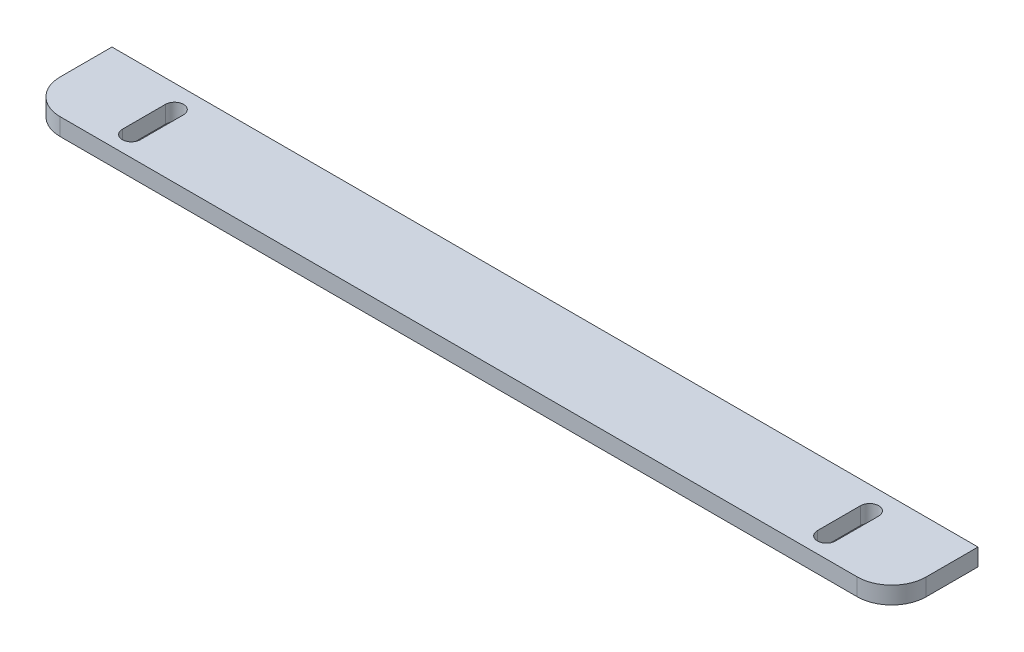
ISO-10303-21;
HEADER;
FILE_DESCRIPTION(('STEP AP214'),'2;1');
FILE_NAME('part.step','',(''),(''),'','','');
FILE_SCHEMA(('AUTOMOTIVE_DESIGN { 1 0 10303 214 1 1 1 1 }'));
ENDSEC;
DATA;
#1=APPLICATION_CONTEXT('core data for automotive mechanical design processes');
#2=APPLICATION_PROTOCOL_DEFINITION('international standard','automotive_design',2000,#1);
#3=PRODUCT_CONTEXT('',#1,'mechanical');
#4=PRODUCT('Part','Part','',(#3));
#5=PRODUCT_RELATED_PRODUCT_CATEGORY('part','',(#4));
#6=PRODUCT_DEFINITION_FORMATION('','',#4);
#7=PRODUCT_DEFINITION_CONTEXT('part definition',#1,'design');
#8=PRODUCT_DEFINITION('design','',#6,#7);
#9=PRODUCT_DEFINITION_SHAPE('','',#8);
#10=(LENGTH_UNIT() NAMED_UNIT(*) SI_UNIT(.MILLI.,.METRE.));
#11=(NAMED_UNIT(*) PLANE_ANGLE_UNIT() SI_UNIT($,.RADIAN.));
#12=(NAMED_UNIT(*) SI_UNIT($,.STERADIAN.) SOLID_ANGLE_UNIT());
#13=UNCERTAINTY_MEASURE_WITH_UNIT(LENGTH_MEASURE(1.E-05),#10,'distance_accuracy_value','');
#14=(GEOMETRIC_REPRESENTATION_CONTEXT(3) GLOBAL_UNCERTAINTY_ASSIGNED_CONTEXT((#13)) GLOBAL_UNIT_ASSIGNED_CONTEXT((#10,
#11,#12)) REPRESENTATION_CONTEXT('',''));
#15=CARTESIAN_POINT('',(0.,0.,0.));
#16=DIRECTION('',(0.,0.,1.));
#17=DIRECTION('',(1.,0.,0.));
#18=AXIS2_PLACEMENT_3D('',#15,#16,#17);
#19=CARTESIAN_POINT('',(10.,5.,-10.));
#20=DIRECTION('',(0.,-1.,0.));
#21=DIRECTION('',(0.,0.,-1.));
#22=AXIS2_PLACEMENT_3D('',#19,#20,#21);
#23=PLANE('',#22);
#24=CARTESIAN_POINT('',(24.77,5.,-18.3595406360424));
#25=DIRECTION('',(0.,1.,0.));
#26=DIRECTION('',(0.,0.,1.));
#27=AXIS2_PLACEMENT_3D('',#24,#25,#26);
#28=CIRCLE('',#27,2.62500000000004);
#29=CARTESIAN_POINT('',(27.3950000000001,5.,-18.3595406360424));
#30=VERTEX_POINT('',#29);
#31=CARTESIAN_POINT('',(22.145,5.,-18.3595406360424));
#32=VERTEX_POINT('',#31);
#33=EDGE_CURVE('E170',#30,#32,#28,.T.);
#34=ORIENTED_EDGE('',*,*,#33,.F.);
#35=DIRECTION('',(0.,0.,-1.));
#36=VECTOR('',#35,1.);
#37=CARTESIAN_POINT('',(27.3950000000001,5.,-18.3595406360424));
#38=LINE('',#37,#36);
#39=CARTESIAN_POINT('',(27.395,5.,-5.85954063604238));
#40=VERTEX_POINT('',#39);
#41=EDGE_CURVE('E178',#40,#30,#38,.T.);
#42=ORIENTED_EDGE('',*,*,#41,.F.);
#43=CARTESIAN_POINT('',(24.77,5.,-5.85954063604238));
#44=DIRECTION('',(0.,1.,0.));
#45=DIRECTION('',(0.,0.,1.));
#46=AXIS2_PLACEMENT_3D('',#43,#44,#45);
#47=CIRCLE('',#46,2.62499999999999);
#48=CARTESIAN_POINT('',(22.145,5.,-5.85954063604238));
#49=VERTEX_POINT('',#48);
#50=EDGE_CURVE('E175',#49,#40,#47,.T.);
#51=ORIENTED_EDGE('',*,*,#50,.F.);
#52=DIRECTION('',(0.,0.,1.));
#53=VECTOR('',#52,1.);
#54=CARTESIAN_POINT('',(22.145,5.,-18.3595406360424));
#55=LINE('',#54,#53);
#56=EDGE_CURVE('E172',#32,#49,#55,.T.);
#57=ORIENTED_EDGE('',*,*,#56,.F.);
#58=EDGE_LOOP('',(#34,#42,#51,#57));
#59=FACE_BOUND('',#58,.T.);
#60=DIRECTION('',(0.,0.,-1.));
#61=VECTOR('',#60,1.);
#62=CARTESIAN_POINT('',(251.,5.,-10.));
#63=LINE('',#62,#61);
#64=CARTESIAN_POINT('',(251.,5.,-10.));
#65=VERTEX_POINT('',#64);
#66=CARTESIAN_POINT('',(251.,5.,-25.));
#67=VERTEX_POINT('',#66);
#68=EDGE_CURVE('E201',#65,#67,#63,.T.);
#69=ORIENTED_EDGE('',*,*,#68,.T.);
#70=DIRECTION('',(-1.,0.,0.));
#71=VECTOR('',#70,1.);
#72=CARTESIAN_POINT('',(0.,5.,-25.));
#73=LINE('',#72,#71);
#74=CARTESIAN_POINT('',(0.,5.,-25.));
#75=VERTEX_POINT('',#74);
#76=EDGE_CURVE('E204',#67,#75,#73,.T.);
#77=ORIENTED_EDGE('',*,*,#76,.T.);
#78=DIRECTION('',(0.,0.,1.));
#79=VECTOR('',#78,1.);
#80=CARTESIAN_POINT('',(0.,5.,-10.));
#81=LINE('',#80,#79);
#82=CARTESIAN_POINT('',(0.,5.,-10.));
#83=VERTEX_POINT('',#82);
#84=EDGE_CURVE('E207',#75,#83,#81,.T.);
#85=ORIENTED_EDGE('',*,*,#84,.T.);
#86=CARTESIAN_POINT('',(10.,5.,-10.));
#87=DIRECTION('',(0.,1.,0.));
#88=DIRECTION('',(0.,0.,-1.));
#89=AXIS2_PLACEMENT_3D('',#86,#87,#88);
#90=CIRCLE('',#89,10.);
#91=CARTESIAN_POINT('',(10.,5.,0.));
#92=VERTEX_POINT('',#91);
#93=EDGE_CURVE('E209',#83,#92,#90,.T.);
#94=ORIENTED_EDGE('',*,*,#93,.T.);
#95=DIRECTION('',(1.,0.,0.));
#96=VECTOR('',#95,1.);
#97=CARTESIAN_POINT('',(10.,5.,0.));
#98=LINE('',#97,#96);
#99=CARTESIAN_POINT('',(241.,5.,0.));
#100=VERTEX_POINT('',#99);
#101=EDGE_CURVE('E211',#92,#100,#98,.T.);
#102=ORIENTED_EDGE('',*,*,#101,.T.);
#103=CARTESIAN_POINT('',(241.,5.,-10.));
#104=DIRECTION('',(0.,1.,0.));
#105=DIRECTION('',(0.,0.,1.));
#106=AXIS2_PLACEMENT_3D('',#103,#104,#105);
#107=CIRCLE('',#106,9.99999999999999);
#108=EDGE_CURVE('E213',#100,#65,#107,.T.);
#109=ORIENTED_EDGE('',*,*,#108,.T.);
#110=EDGE_LOOP('',(#69,#77,#85,#94,#102,#109));
#111=FACE_BOUND('',#110,.T.);
#112=CARTESIAN_POINT('',(226.23,5.,-18.3595406360424));
#113=DIRECTION('',(0.,1.,0.));
#114=DIRECTION('',(0.,0.,-1.));
#115=AXIS2_PLACEMENT_3D('',#112,#113,#114);
#116=CIRCLE('',#115,2.62500000000004);
#117=CARTESIAN_POINT('',(228.855,5.,-18.3595406360424));
#118=VERTEX_POINT('',#117);
#119=CARTESIAN_POINT('',(223.605,5.,-18.3595406360424));
#120=VERTEX_POINT('',#119);
#121=EDGE_CURVE('E134',#118,#120,#116,.T.);
#122=ORIENTED_EDGE('',*,*,#121,.F.);
#123=DIRECTION('',(0.,0.,-1.));
#124=VECTOR('',#123,1.);
#125=CARTESIAN_POINT('',(228.855,5.,-18.3595406360424));
#126=LINE('',#125,#124);
#127=CARTESIAN_POINT('',(228.855,5.,-5.85954063604238));
#128=VERTEX_POINT('',#127);
#129=EDGE_CURVE('E156',#128,#118,#126,.T.);
#130=ORIENTED_EDGE('',*,*,#129,.F.);
#131=CARTESIAN_POINT('',(226.23,5.,-5.85954063604238));
#132=DIRECTION('',(0.,1.,0.));
#133=DIRECTION('',(0.,0.,-1.));
#134=AXIS2_PLACEMENT_3D('',#131,#132,#133);
#135=CIRCLE('',#134,2.62499999999999);
#136=CARTESIAN_POINT('',(223.605,5.,-5.85954063604238));
#137=VERTEX_POINT('',#136);
#138=EDGE_CURVE('E154',#137,#128,#135,.T.);
#139=ORIENTED_EDGE('',*,*,#138,.F.);
#140=DIRECTION('',(0.,0.,1.));
#141=VECTOR('',#140,1.);
#142=CARTESIAN_POINT('',(223.605,5.,-18.3595406360424));
#143=LINE('',#142,#141);
#144=EDGE_CURVE('E142',#120,#137,#143,.T.);
#145=ORIENTED_EDGE('',*,*,#144,.F.);
#146=EDGE_LOOP('',(#122,#130,#139,#145));
#147=FACE_BOUND('',#146,.T.);
#148=ADVANCED_FACE('F33',(#59,#111,#147),#23,.F.);
#149=CARTESIAN_POINT('',(10.,0.,-10.));
#150=DIRECTION('',(0.,-1.,0.));
#151=DIRECTION('',(0.,0.,-1.));
#152=AXIS2_PLACEMENT_3D('',#149,#150,#151);
#153=PLANE('',#152);
#154=DIRECTION('',(0.,0.,-1.));
#155=VECTOR('',#154,1.);
#156=CARTESIAN_POINT('',(27.3950000000001,0.,-18.3595406360424));
#157=LINE('',#156,#155);
#158=CARTESIAN_POINT('',(27.395,0.,-5.85954063604238));
#159=VERTEX_POINT('',#158);
#160=CARTESIAN_POINT('',(27.3950000000001,0.,-18.3595406360424));
#161=VERTEX_POINT('',#160);
#162=EDGE_CURVE('E173',#159,#161,#157,.T.);
#163=ORIENTED_EDGE('',*,*,#162,.T.);
#164=CARTESIAN_POINT('',(24.77,0.,-18.3595406360424));
#165=DIRECTION('',(0.,1.,0.));
#166=DIRECTION('',(0.,0.,1.));
#167=AXIS2_PLACEMENT_3D('',#164,#165,#166);
#168=CIRCLE('',#167,2.62500000000004);
#169=CARTESIAN_POINT('',(22.145,0.,-18.3595406360424));
#170=VERTEX_POINT('',#169);
#171=EDGE_CURVE('E150',#161,#170,#168,.T.);
#172=ORIENTED_EDGE('',*,*,#171,.T.);
#173=DIRECTION('',(0.,0.,1.));
#174=VECTOR('',#173,1.);
#175=CARTESIAN_POINT('',(22.145,0.,-18.3595406360424));
#176=LINE('',#175,#174);
#177=CARTESIAN_POINT('',(22.145,0.,-5.85954063604238));
#178=VERTEX_POINT('',#177);
#179=EDGE_CURVE('E183',#170,#178,#176,.T.);
#180=ORIENTED_EDGE('',*,*,#179,.T.);
#181=CARTESIAN_POINT('',(24.77,0.,-5.85954063604238));
#182=DIRECTION('',(0.,1.,0.));
#183=DIRECTION('',(0.,0.,1.));
#184=AXIS2_PLACEMENT_3D('',#181,#182,#183);
#185=CIRCLE('',#184,2.62499999999999);
#186=EDGE_CURVE('E186',#178,#159,#185,.T.);
#187=ORIENTED_EDGE('',*,*,#186,.T.);
#188=EDGE_LOOP('',(#163,#172,#180,#187));
#189=FACE_BOUND('',#188,.T.);
#190=DIRECTION('',(0.,0.,-1.));
#191=VECTOR('',#190,1.);
#192=CARTESIAN_POINT('',(251.,0.,-10.));
#193=LINE('',#192,#191);
#194=CARTESIAN_POINT('',(251.,0.,-10.));
#195=VERTEX_POINT('',#194);
#196=CARTESIAN_POINT('',(251.,0.,-25.));
#197=VERTEX_POINT('',#196);
#198=EDGE_CURVE('E200',#195,#197,#193,.T.);
#199=ORIENTED_EDGE('',*,*,#198,.F.);
#200=CARTESIAN_POINT('',(241.,0.,-10.));
#201=DIRECTION('',(0.,1.,0.));
#202=DIRECTION('',(0.,0.,1.));
#203=AXIS2_PLACEMENT_3D('',#200,#201,#202);
#204=CIRCLE('',#203,9.99999999999999);
#205=CARTESIAN_POINT('',(241.,0.,0.));
#206=VERTEX_POINT('',#205);
#207=EDGE_CURVE('E205',#206,#195,#204,.T.);
#208=ORIENTED_EDGE('',*,*,#207,.F.);
#209=DIRECTION('',(1.,0.,0.));
#210=VECTOR('',#209,1.);
#211=CARTESIAN_POINT('',(10.,0.,0.));
#212=LINE('',#211,#210);
#213=CARTESIAN_POINT('',(10.,0.,0.));
#214=VERTEX_POINT('',#213);
#215=EDGE_CURVE('E224',#214,#206,#212,.T.);
#216=ORIENTED_EDGE('',*,*,#215,.F.);
#217=CARTESIAN_POINT('',(10.,0.,-10.));
#218=DIRECTION('',(0.,1.,0.));
#219=DIRECTION('',(0.,0.,-1.));
#220=AXIS2_PLACEMENT_3D('',#217,#218,#219);
#221=CIRCLE('',#220,10.);
#222=CARTESIAN_POINT('',(0.,0.,-10.));
#223=VERTEX_POINT('',#222);
#224=EDGE_CURVE('E222',#223,#214,#221,.T.);
#225=ORIENTED_EDGE('',*,*,#224,.F.);
#226=DIRECTION('',(0.,0.,1.));
#227=VECTOR('',#226,1.);
#228=CARTESIAN_POINT('',(0.,0.,-10.));
#229=LINE('',#228,#227);
#230=CARTESIAN_POINT('',(0.,0.,-25.));
#231=VERTEX_POINT('',#230);
#232=EDGE_CURVE('E220',#231,#223,#229,.T.);
#233=ORIENTED_EDGE('',*,*,#232,.F.);
#234=DIRECTION('',(-1.,0.,0.));
#235=VECTOR('',#234,1.);
#236=CARTESIAN_POINT('',(0.,0.,-25.));
#237=LINE('',#236,#235);
#238=EDGE_CURVE('E218',#197,#231,#237,.T.);
#239=ORIENTED_EDGE('',*,*,#238,.F.);
#240=EDGE_LOOP('',(#199,#208,#216,#225,#233,#239));
#241=FACE_BOUND('',#240,.T.);
#242=DIRECTION('',(0.,0.,-1.));
#243=VECTOR('',#242,1.);
#244=CARTESIAN_POINT('',(228.855,0.,-18.3595406360424));
#245=LINE('',#244,#243);
#246=CARTESIAN_POINT('',(228.855,0.,-5.85954063604238));
#247=VERTEX_POINT('',#246);
#248=CARTESIAN_POINT('',(228.855,0.,-18.3595406360424));
#249=VERTEX_POINT('',#248);
#250=EDGE_CURVE('E143',#247,#249,#245,.T.);
#251=ORIENTED_EDGE('',*,*,#250,.T.);
#252=CARTESIAN_POINT('',(226.23,0.,-18.3595406360424));
#253=DIRECTION('',(0.,1.,0.));
#254=DIRECTION('',(0.,0.,-1.));
#255=AXIS2_PLACEMENT_3D('',#252,#253,#254);
#256=CIRCLE('',#255,2.62500000000004);
#257=CARTESIAN_POINT('',(223.605,0.,-18.3595406360424));
#258=VERTEX_POINT('',#257);
#259=EDGE_CURVE('E56',#249,#258,#256,.T.);
#260=ORIENTED_EDGE('',*,*,#259,.T.);
#261=DIRECTION('',(0.,0.,1.));
#262=VECTOR('',#261,1.);
#263=CARTESIAN_POINT('',(223.605,0.,-18.3595406360424));
#264=LINE('',#263,#262);
#265=CARTESIAN_POINT('',(223.605,0.,-5.85954063604238));
#266=VERTEX_POINT('',#265);
#267=EDGE_CURVE('E149',#258,#266,#264,.T.);
#268=ORIENTED_EDGE('',*,*,#267,.T.);
#269=CARTESIAN_POINT('',(226.23,0.,-5.85954063604238));
#270=DIRECTION('',(0.,1.,0.));
#271=DIRECTION('',(0.,0.,-1.));
#272=AXIS2_PLACEMENT_3D('',#269,#270,#271);
#273=CIRCLE('',#272,2.62499999999999);
#274=EDGE_CURVE('E162',#266,#247,#273,.T.);
#275=ORIENTED_EDGE('',*,*,#274,.T.);
#276=EDGE_LOOP('',(#251,#260,#268,#275));
#277=FACE_BOUND('',#276,.T.);
#278=ADVANCED_FACE('F248',(#189,#241,#277),#153,.T.);
#279=CARTESIAN_POINT('',(251.,5.,-10.));
#280=DIRECTION('',(-1.,0.,0.));
#281=DIRECTION('',(0.,0.,1.));
#282=AXIS2_PLACEMENT_3D('',#279,#280,#281);
#283=PLANE('',#282);
#284=ORIENTED_EDGE('',*,*,#198,.T.);
#285=DIRECTION('',(0.,-1.,0.));
#286=VECTOR('',#285,1.);
#287=CARTESIAN_POINT('',(251.,5.,-25.));
#288=LINE('',#287,#286);
#289=EDGE_CURVE('E11',#67,#197,#288,.T.);
#290=ORIENTED_EDGE('',*,*,#289,.F.);
#291=ORIENTED_EDGE('',*,*,#68,.F.);
#292=DIRECTION('',(0.,-1.,0.));
#293=VECTOR('',#292,1.);
#294=CARTESIAN_POINT('',(251.,5.,-10.));
#295=LINE('',#294,#293);
#296=EDGE_CURVE('E215',#65,#195,#295,.T.);
#297=ORIENTED_EDGE('',*,*,#296,.T.);
#298=EDGE_LOOP('',(#284,#290,#291,#297));
#299=FACE_BOUND('',#298,.T.);
#300=ADVANCED_FACE('F35',(#299),#283,.F.);
#301=CARTESIAN_POINT('',(0.,5.,-25.));
#302=DIRECTION('',(0.,0.,1.));
#303=DIRECTION('',(1.,0.,0.));
#304=AXIS2_PLACEMENT_3D('',#301,#302,#303);
#305=PLANE('',#304);
#306=ORIENTED_EDGE('',*,*,#238,.T.);
#307=DIRECTION('',(0.,-1.,0.));
#308=VECTOR('',#307,1.);
#309=CARTESIAN_POINT('',(0.,5.,-25.));
#310=LINE('',#309,#308);
#311=EDGE_CURVE('E41',#75,#231,#310,.T.);
#312=ORIENTED_EDGE('',*,*,#311,.F.);
#313=ORIENTED_EDGE('',*,*,#76,.F.);
#314=ORIENTED_EDGE('',*,*,#289,.T.);
#315=EDGE_LOOP('',(#306,#312,#313,#314));
#316=FACE_BOUND('',#315,.T.);
#317=ADVANCED_FACE('F265',(#316),#305,.F.);
#318=CARTESIAN_POINT('',(0.,5.,-10.));
#319=DIRECTION('',(1.,0.,0.));
#320=DIRECTION('',(0.,0.,-1.));
#321=AXIS2_PLACEMENT_3D('',#318,#319,#320);
#322=PLANE('',#321);
#323=ORIENTED_EDGE('',*,*,#232,.T.);
#324=DIRECTION('',(0.,-1.,0.));
#325=VECTOR('',#324,1.);
#326=CARTESIAN_POINT('',(0.,5.,-10.));
#327=LINE('',#326,#325);
#328=EDGE_CURVE('E235',#83,#223,#327,.T.);
#329=ORIENTED_EDGE('',*,*,#328,.F.);
#330=ORIENTED_EDGE('',*,*,#84,.F.);
#331=ORIENTED_EDGE('',*,*,#311,.T.);
#332=EDGE_LOOP('',(#323,#329,#330,#331));
#333=FACE_BOUND('',#332,.T.);
#334=ADVANCED_FACE('F242',(#333),#322,.F.);
#335=CARTESIAN_POINT('',(10.,5.,-10.));
#336=DIRECTION('',(0.,-1.,0.));
#337=DIRECTION('',(0.,0.,-1.));
#338=AXIS2_PLACEMENT_3D('',#335,#336,#337);
#339=CYLINDRICAL_SURFACE('',#338,10.);
#340=ORIENTED_EDGE('',*,*,#224,.T.);
#341=DIRECTION('',(0.,-1.,0.));
#342=VECTOR('',#341,1.);
#343=CARTESIAN_POINT('',(10.,5.,0.));
#344=LINE('',#343,#342);
#345=EDGE_CURVE('E232',#92,#214,#344,.T.);
#346=ORIENTED_EDGE('',*,*,#345,.F.);
#347=ORIENTED_EDGE('',*,*,#93,.F.);
#348=ORIENTED_EDGE('',*,*,#328,.T.);
#349=EDGE_LOOP('',(#340,#346,#347,#348));
#350=FACE_BOUND('',#349,.T.);
#351=ADVANCED_FACE('F254',(#350),#339,.T.);
#352=CARTESIAN_POINT('',(10.,5.,0.));
#353=DIRECTION('',(0.,0.,-1.));
#354=DIRECTION('',(-1.,0.,0.));
#355=AXIS2_PLACEMENT_3D('',#352,#353,#354);
#356=PLANE('',#355);
#357=ORIENTED_EDGE('',*,*,#215,.T.);
#358=DIRECTION('',(0.,-1.,0.));
#359=VECTOR('',#358,1.);
#360=CARTESIAN_POINT('',(241.,5.,0.));
#361=LINE('',#360,#359);
#362=EDGE_CURVE('E229',#100,#206,#361,.T.);
#363=ORIENTED_EDGE('',*,*,#362,.F.);
#364=ORIENTED_EDGE('',*,*,#101,.F.);
#365=ORIENTED_EDGE('',*,*,#345,.T.);
#366=EDGE_LOOP('',(#357,#363,#364,#365));
#367=FACE_BOUND('',#366,.T.);
#368=ADVANCED_FACE('F258',(#367),#356,.F.);
#369=CARTESIAN_POINT('',(241.,5.,-10.));
#370=DIRECTION('',(0.,-1.,0.));
#371=DIRECTION('',(0.,0.,-1.));
#372=AXIS2_PLACEMENT_3D('',#369,#370,#371);
#373=CYLINDRICAL_SURFACE('',#372,9.99999999999999);
#374=ORIENTED_EDGE('',*,*,#207,.T.);
#375=ORIENTED_EDGE('',*,*,#296,.F.);
#376=ORIENTED_EDGE('',*,*,#108,.F.);
#377=ORIENTED_EDGE('',*,*,#362,.T.);
#378=EDGE_LOOP('',(#374,#375,#376,#377));
#379=FACE_BOUND('',#378,.T.);
#380=ADVANCED_FACE('F268',(#379),#373,.T.);
#381=CARTESIAN_POINT('',(24.77,5.,-18.3595406360424));
#382=DIRECTION('',(0.,-1.,0.));
#383=DIRECTION('',(0.,0.,-1.));
#384=AXIS2_PLACEMENT_3D('',#381,#382,#383);
#385=CYLINDRICAL_SURFACE('',#384,2.62500000000004);
#386=ORIENTED_EDGE('',*,*,#171,.F.);
#387=DIRECTION('',(0.,-1.,0.));
#388=VECTOR('',#387,1.);
#389=CARTESIAN_POINT('',(27.3950000000001,5.,-18.3595406360424));
#390=LINE('',#389,#388);
#391=EDGE_CURVE('E180',#30,#161,#390,.T.);
#392=ORIENTED_EDGE('',*,*,#391,.F.);
#393=ORIENTED_EDGE('',*,*,#33,.T.);
#394=DIRECTION('',(0.,-1.,0.));
#395=VECTOR('',#394,1.);
#396=CARTESIAN_POINT('',(22.145,5.,-18.3595406360424));
#397=LINE('',#396,#395);
#398=EDGE_CURVE('E197',#32,#170,#397,.T.);
#399=ORIENTED_EDGE('',*,*,#398,.T.);
#400=EDGE_LOOP('',(#386,#392,#393,#399));
#401=FACE_BOUND('',#400,.T.);
#402=ADVANCED_FACE('F270',(#401),#385,.F.);
#403=CARTESIAN_POINT('',(22.145,5.,-18.3595406360424));
#404=DIRECTION('',(1.,0.,0.));
#405=DIRECTION('',(0.,0.,-1.));
#406=AXIS2_PLACEMENT_3D('',#403,#404,#405);
#407=PLANE('',#406);
#408=ORIENTED_EDGE('',*,*,#179,.F.);
#409=ORIENTED_EDGE('',*,*,#398,.F.);
#410=ORIENTED_EDGE('',*,*,#56,.T.);
#411=DIRECTION('',(0.,-1.,0.));
#412=VECTOR('',#411,1.);
#413=CARTESIAN_POINT('',(22.145,5.,-5.85954063604238));
#414=LINE('',#413,#412);
#415=EDGE_CURVE('E195',#49,#178,#414,.T.);
#416=ORIENTED_EDGE('',*,*,#415,.T.);
#417=EDGE_LOOP('',(#408,#409,#410,#416));
#418=FACE_BOUND('',#417,.T.);
#419=ADVANCED_FACE('F276',(#418),#407,.T.);
#420=CARTESIAN_POINT('',(24.77,5.,-5.85954063604238));
#421=DIRECTION('',(0.,-1.,0.));
#422=DIRECTION('',(0.,0.,-1.));
#423=AXIS2_PLACEMENT_3D('',#420,#421,#422);
#424=CYLINDRICAL_SURFACE('',#423,2.62499999999999);
#425=ORIENTED_EDGE('',*,*,#186,.F.);
#426=ORIENTED_EDGE('',*,*,#415,.F.);
#427=ORIENTED_EDGE('',*,*,#50,.T.);
#428=DIRECTION('',(0.,-1.,0.));
#429=VECTOR('',#428,1.);
#430=CARTESIAN_POINT('',(27.395,5.,-5.85954063604238));
#431=LINE('',#430,#429);
#432=EDGE_CURVE('E193',#40,#159,#431,.T.);
#433=ORIENTED_EDGE('',*,*,#432,.T.);
#434=EDGE_LOOP('',(#425,#426,#427,#433));
#435=FACE_BOUND('',#434,.T.);
#436=ADVANCED_FACE('F292',(#435),#424,.F.);
#437=CARTESIAN_POINT('',(27.3950000000001,5.,-18.3595406360424));
#438=DIRECTION('',(-1.,0.,0.));
#439=DIRECTION('',(0.,0.,1.));
#440=AXIS2_PLACEMENT_3D('',#437,#438,#439);
#441=PLANE('',#440);
#442=ORIENTED_EDGE('',*,*,#162,.F.);
#443=ORIENTED_EDGE('',*,*,#432,.F.);
#444=ORIENTED_EDGE('',*,*,#41,.T.);
#445=ORIENTED_EDGE('',*,*,#391,.T.);
#446=EDGE_LOOP('',(#442,#443,#444,#445));
#447=FACE_BOUND('',#446,.T.);
#448=ADVANCED_FACE('F296',(#447),#441,.T.);
#449=CARTESIAN_POINT('',(226.23,5.,-18.3595406360424));
#450=DIRECTION('',(0.,-1.,0.));
#451=DIRECTION('',(0.,0.,-1.));
#452=AXIS2_PLACEMENT_3D('',#449,#450,#451);
#453=CYLINDRICAL_SURFACE('',#452,2.62500000000004);
#454=ORIENTED_EDGE('',*,*,#259,.F.);
#455=DIRECTION('',(0.,-1.,0.));
#456=VECTOR('',#455,1.);
#457=CARTESIAN_POINT('',(228.855,5.,-18.3595406360424));
#458=LINE('',#457,#456);
#459=EDGE_CURVE('E138',#118,#249,#458,.T.);
#460=ORIENTED_EDGE('',*,*,#459,.F.);
#461=ORIENTED_EDGE('',*,*,#121,.T.);
#462=DIRECTION('',(0.,-1.,0.));
#463=VECTOR('',#462,1.);
#464=CARTESIAN_POINT('',(223.605,5.,-18.3595406360424));
#465=LINE('',#464,#463);
#466=EDGE_CURVE('E137',#120,#258,#465,.T.);
#467=ORIENTED_EDGE('',*,*,#466,.T.);
#468=EDGE_LOOP('',(#454,#460,#461,#467));
#469=FACE_BOUND('',#468,.T.);
#470=ADVANCED_FACE('F136',(#469),#453,.F.);
#471=CARTESIAN_POINT('',(223.605,5.,-18.3595406360424));
#472=DIRECTION('',(1.,0.,0.));
#473=DIRECTION('',(0.,0.,-1.));
#474=AXIS2_PLACEMENT_3D('',#471,#472,#473);
#475=PLANE('',#474);
#476=ORIENTED_EDGE('',*,*,#267,.F.);
#477=ORIENTED_EDGE('',*,*,#466,.F.);
#478=ORIENTED_EDGE('',*,*,#144,.T.);
#479=DIRECTION('',(0.,-1.,0.));
#480=VECTOR('',#479,1.);
#481=CARTESIAN_POINT('',(223.605,5.,-5.85954063604238));
#482=LINE('',#481,#480);
#483=EDGE_CURVE('E151',#137,#266,#482,.T.);
#484=ORIENTED_EDGE('',*,*,#483,.T.);
#485=EDGE_LOOP('',(#476,#477,#478,#484));
#486=FACE_BOUND('',#485,.T.);
#487=ADVANCED_FACE('F146',(#486),#475,.T.);
#488=CARTESIAN_POINT('',(226.23,5.,-5.85954063604238));
#489=DIRECTION('',(0.,-1.,0.));
#490=DIRECTION('',(0.,0.,-1.));
#491=AXIS2_PLACEMENT_3D('',#488,#489,#490);
#492=CYLINDRICAL_SURFACE('',#491,2.62499999999999);
#493=ORIENTED_EDGE('',*,*,#274,.F.);
#494=ORIENTED_EDGE('',*,*,#483,.F.);
#495=ORIENTED_EDGE('',*,*,#138,.T.);
#496=DIRECTION('',(0.,-1.,0.));
#497=VECTOR('',#496,1.);
#498=CARTESIAN_POINT('',(228.855,5.,-5.85954063604238));
#499=LINE('',#498,#497);
#500=EDGE_CURVE('E48',#128,#247,#499,.T.);
#501=ORIENTED_EDGE('',*,*,#500,.T.);
#502=EDGE_LOOP('',(#493,#494,#495,#501));
#503=FACE_BOUND('',#502,.T.);
#504=ADVANCED_FACE('F305',(#503),#492,.F.);
#505=CARTESIAN_POINT('',(228.855,5.,-18.3595406360424));
#506=DIRECTION('',(-1.,0.,0.));
#507=DIRECTION('',(0.,0.,1.));
#508=AXIS2_PLACEMENT_3D('',#505,#506,#507);
#509=PLANE('',#508);
#510=ORIENTED_EDGE('',*,*,#250,.F.);
#511=ORIENTED_EDGE('',*,*,#500,.F.);
#512=ORIENTED_EDGE('',*,*,#129,.T.);
#513=ORIENTED_EDGE('',*,*,#459,.T.);
#514=EDGE_LOOP('',(#510,#511,#512,#513));
#515=FACE_BOUND('',#514,.T.);
#516=ADVANCED_FACE('F308',(#515),#509,.T.);
#517=CLOSED_SHELL('',(#148,#278,#300,#317,#334,#351,#368,#380,#402,#419,#436,#448,#470,#487,
#504,#516));
#518=MANIFOLD_SOLID_BREP('B2',#517);
#519=ADVANCED_BREP_SHAPE_REPRESENTATION('',(#18,#518),#14);
#520=SHAPE_DEFINITION_REPRESENTATION(#9,#519);
ENDSEC;
END-ISO-10303-21;
